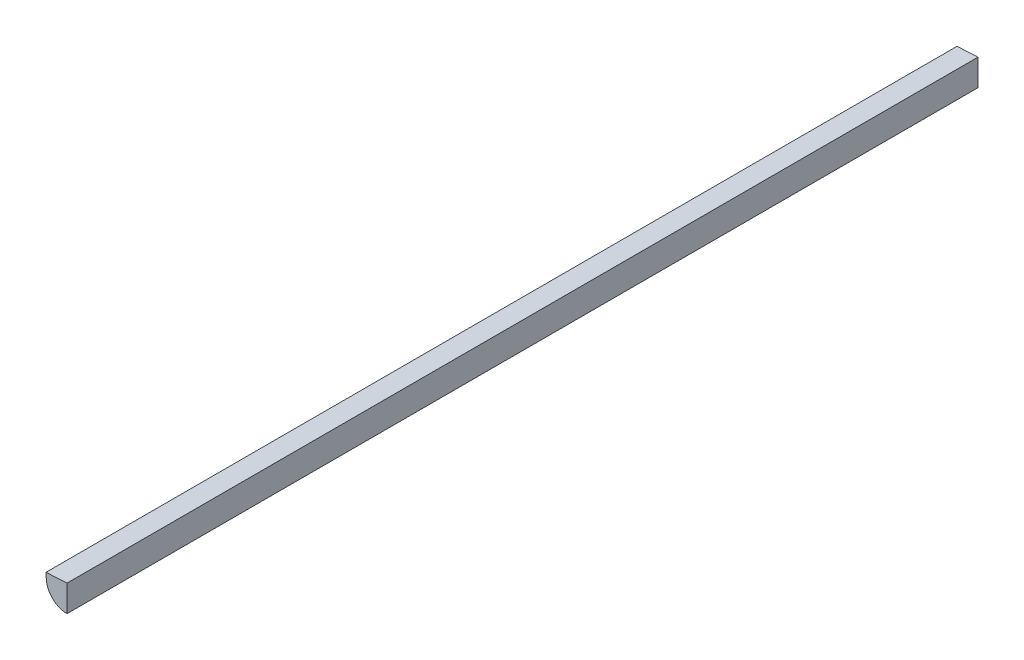
ISO-10303-21;
HEADER;
FILE_DESCRIPTION(('STEP AP214'),'2;1');
FILE_NAME('part.step','',(''),(''),'','','');
FILE_SCHEMA(('AUTOMOTIVE_DESIGN { 1 0 10303 214 1 1 1 1 }'));
ENDSEC;
DATA;
#1=APPLICATION_CONTEXT('core data for automotive mechanical design processes');
#2=APPLICATION_PROTOCOL_DEFINITION('international standard','automotive_design',2000,#1);
#3=PRODUCT_CONTEXT('',#1,'mechanical');
#4=PRODUCT('Part','Part','',(#3));
#5=PRODUCT_RELATED_PRODUCT_CATEGORY('part','',(#4));
#6=PRODUCT_DEFINITION_FORMATION('','',#4);
#7=PRODUCT_DEFINITION_CONTEXT('part definition',#1,'design');
#8=PRODUCT_DEFINITION('design','',#6,#7);
#9=PRODUCT_DEFINITION_SHAPE('','',#8);
#10=(LENGTH_UNIT() NAMED_UNIT(*) SI_UNIT(.MILLI.,.METRE.));
#11=(NAMED_UNIT(*) PLANE_ANGLE_UNIT() SI_UNIT($,.RADIAN.));
#12=(NAMED_UNIT(*) SI_UNIT($,.STERADIAN.) SOLID_ANGLE_UNIT());
#13=UNCERTAINTY_MEASURE_WITH_UNIT(LENGTH_MEASURE(1.E-05),#10,'distance_accuracy_value','');
#14=(GEOMETRIC_REPRESENTATION_CONTEXT(3) GLOBAL_UNCERTAINTY_ASSIGNED_CONTEXT((#13)) GLOBAL_UNIT_ASSIGNED_CONTEXT((#10,
#11,#12)) REPRESENTATION_CONTEXT('',''));
#15=CARTESIAN_POINT('',(0.,0.,0.));
#16=DIRECTION('',(0.,0.,1.));
#17=DIRECTION('',(1.,0.,0.));
#18=AXIS2_PLACEMENT_3D('',#15,#16,#17);
#19=CARTESIAN_POINT('',(0.,0.,550.));
#20=DIRECTION('',(0.,0.,-1.));
#21=DIRECTION('',(-1.,0.,0.));
#22=AXIS2_PLACEMENT_3D('',#19,#20,#21);
#23=CYLINDRICAL_SURFACE('',#22,12.5);
#24=CARTESIAN_POINT('',(0.,0.,0.));
#25=DIRECTION('',(0.,0.,1.));
#26=DIRECTION('',(1.,0.,0.));
#27=AXIS2_PLACEMENT_3D('',#24,#25,#26);
#28=CIRCLE('',#27,12.5);
#29=CARTESIAN_POINT('',(-12.4828691844322,-0.654199453036755,0.));
#30=VERTEX_POINT('',#29);
#31=CARTESIAN_POINT('',(0.,-12.5,0.));
#32=VERTEX_POINT('',#31);
#33=EDGE_CURVE('E97',#30,#32,#28,.T.);
#34=ORIENTED_EDGE('',*,*,#33,.T.);
#35=DIRECTION('',(0.,0.,-1.));
#36=VECTOR('',#35,1.);
#37=CARTESIAN_POINT('',(0.,-12.5,550.));
#38=LINE('',#37,#36);
#39=CARTESIAN_POINT('',(0.,-12.5,550.));
#40=VERTEX_POINT('',#39);
#41=EDGE_CURVE('E11',#40,#32,#38,.T.);
#42=ORIENTED_EDGE('',*,*,#41,.F.);
#43=CARTESIAN_POINT('',(0.,0.,550.));
#44=DIRECTION('',(0.,0.,1.));
#45=DIRECTION('',(1.,0.,0.));
#46=AXIS2_PLACEMENT_3D('',#43,#44,#45);
#47=CIRCLE('',#46,12.5);
#48=CARTESIAN_POINT('',(-12.4828691844322,-0.654199453036755,550.));
#49=VERTEX_POINT('',#48);
#50=EDGE_CURVE('E85',#49,#40,#47,.T.);
#51=ORIENTED_EDGE('',*,*,#50,.F.);
#52=DIRECTION('',(0.,0.,-1.));
#53=VECTOR('',#52,1.);
#54=CARTESIAN_POINT('',(-12.4828691844322,-0.654199453036755,550.));
#55=LINE('',#54,#53);
#56=EDGE_CURVE('E93',#49,#30,#55,.T.);
#57=ORIENTED_EDGE('',*,*,#56,.T.);
#58=EDGE_LOOP('',(#34,#42,#51,#57));
#59=FACE_BOUND('',#58,.T.);
#60=ADVANCED_FACE('F34',(#59),#23,.T.);
#61=CARTESIAN_POINT('',(0.,3.48477576407277,550.));
#62=DIRECTION('',(-1.,0.,0.));
#63=DIRECTION('',(0.,-1.,0.));
#64=AXIS2_PLACEMENT_3D('',#61,#62,#63);
#65=PLANE('',#64);
#66=DIRECTION('',(0.,1.,0.));
#67=VECTOR('',#66,1.);
#68=CARTESIAN_POINT('',(0.,3.48477576407277,0.));
#69=LINE('',#68,#67);
#70=CARTESIAN_POINT('',(0.,3.48477576407277,0.));
#71=VERTEX_POINT('',#70);
#72=EDGE_CURVE('E89',#32,#71,#69,.T.);
#73=ORIENTED_EDGE('',*,*,#72,.T.);
#74=DIRECTION('',(0.,0.,-1.));
#75=VECTOR('',#74,1.);
#76=CARTESIAN_POINT('',(0.,3.48477576407277,550.));
#77=LINE('',#76,#75);
#78=CARTESIAN_POINT('',(0.,3.48477576407277,550.));
#79=VERTEX_POINT('',#78);
#80=EDGE_CURVE('E42',#79,#71,#77,.T.);
#81=ORIENTED_EDGE('',*,*,#80,.F.);
#82=DIRECTION('',(0.,1.,0.));
#83=VECTOR('',#82,1.);
#84=CARTESIAN_POINT('',(0.,0.,550.));
#85=LINE('',#84,#83);
#86=EDGE_CURVE('E80',#40,#79,#85,.T.);
#87=ORIENTED_EDGE('',*,*,#86,.F.);
#88=ORIENTED_EDGE('',*,*,#41,.T.);
#89=EDGE_LOOP('',(#73,#81,#87,#88));
#90=FACE_BOUND('',#89,.T.);
#91=ADVANCED_FACE('F88',(#90),#65,.F.);
#92=CARTESIAN_POINT('',(-12.6649983121576,2.82103132790916,550.));
#93=DIRECTION('',(0.0523359562429408,-0.998629534754574,0.));
#94=DIRECTION('',(0.998629534754574,0.0523359562429408,0.));
#95=AXIS2_PLACEMENT_3D('',#92,#93,#94);
#96=PLANE('',#95);
#97=DIRECTION('',(-0.998629534754574,-0.0523359562429408,0.));
#98=VECTOR('',#97,1.);
#99=CARTESIAN_POINT('',(-12.6649983121576,2.82103132790916,0.));
#100=LINE('',#99,#98);
#101=CARTESIAN_POINT('',(-12.6649983121576,2.82103132790916,0.));
#102=VERTEX_POINT('',#101);
#103=EDGE_CURVE('E67',#71,#102,#100,.T.);
#104=ORIENTED_EDGE('',*,*,#103,.T.);
#105=DIRECTION('',(0.,0.,-1.));
#106=VECTOR('',#105,1.);
#107=CARTESIAN_POINT('',(-12.6649983121576,2.82103132790916,550.));
#108=LINE('',#107,#106);
#109=CARTESIAN_POINT('',(-12.6649983121576,2.82103132790916,550.));
#110=VERTEX_POINT('',#109);
#111=EDGE_CURVE('E90',#110,#102,#108,.T.);
#112=ORIENTED_EDGE('',*,*,#111,.F.);
#113=DIRECTION('',(-0.998629534754574,-0.0523359562429408,0.));
#114=VECTOR('',#113,1.);
#115=CARTESIAN_POINT('',(-12.6649983121576,2.82103132790916,550.));
#116=LINE('',#115,#114);
#117=EDGE_CURVE('E83',#79,#110,#116,.T.);
#118=ORIENTED_EDGE('',*,*,#117,.F.);
#119=ORIENTED_EDGE('',*,*,#80,.T.);
#120=EDGE_LOOP('',(#104,#112,#118,#119));
#121=FACE_BOUND('',#120,.T.);
#122=ADVANCED_FACE('F91',(#121),#96,.F.);
#123=CARTESIAN_POINT('',(-12.4828691844322,-0.654199453036755,550.));
#124=DIRECTION('',(0.998629534754574,0.0523359562429414,0.));
#125=DIRECTION('',(-0.0523359562429414,0.998629534754574,0.));
#126=AXIS2_PLACEMENT_3D('',#123,#124,#125);
#127=PLANE('',#126);
#128=DIRECTION('',(0.0523359562429414,-0.998629534754574,0.));
#129=VECTOR('',#128,1.);
#130=CARTESIAN_POINT('',(-12.4828691844322,-0.654199453036755,0.));
#131=LINE('',#130,#129);
#132=EDGE_CURVE('E73',#102,#30,#131,.T.);
#133=ORIENTED_EDGE('',*,*,#132,.T.);
#134=ORIENTED_EDGE('',*,*,#56,.F.);
#135=DIRECTION('',(0.0523359562429414,-0.998629534754574,0.));
#136=VECTOR('',#135,1.);
#137=CARTESIAN_POINT('',(-12.4828691844322,-0.654199453036755,550.));
#138=LINE('',#137,#136);
#139=EDGE_CURVE('E50',#110,#49,#138,.T.);
#140=ORIENTED_EDGE('',*,*,#139,.F.);
#141=ORIENTED_EDGE('',*,*,#111,.T.);
#142=EDGE_LOOP('',(#133,#134,#140,#141));
#143=FACE_BOUND('',#142,.T.);
#144=ADVANCED_FACE('F104',(#143),#127,.F.);
#145=CARTESIAN_POINT('',(0.,0.,550.));
#146=DIRECTION('',(0.,0.,1.));
#147=DIRECTION('',(1.,0.,0.));
#148=AXIS2_PLACEMENT_3D('',#145,#146,#147);
#149=PLANE('',#148);
#150=ORIENTED_EDGE('',*,*,#50,.T.);
#151=ORIENTED_EDGE('',*,*,#86,.T.);
#152=ORIENTED_EDGE('',*,*,#117,.T.);
#153=ORIENTED_EDGE('',*,*,#139,.T.);
#154=EDGE_LOOP('',(#150,#151,#152,#153));
#155=FACE_BOUND('',#154,.T.);
#156=ADVANCED_FACE('F81',(#155),#149,.T.);
#157=CARTESIAN_POINT('',(0.,0.,0.));
#158=DIRECTION('',(0.,0.,1.));
#159=DIRECTION('',(1.,0.,0.));
#160=AXIS2_PLACEMENT_3D('',#157,#158,#159);
#161=PLANE('',#160);
#162=ORIENTED_EDGE('',*,*,#33,.F.);
#163=ORIENTED_EDGE('',*,*,#132,.F.);
#164=ORIENTED_EDGE('',*,*,#103,.F.);
#165=ORIENTED_EDGE('',*,*,#72,.F.);
#166=EDGE_LOOP('',(#162,#163,#164,#165));
#167=FACE_BOUND('',#166,.T.);
#168=ADVANCED_FACE('F107',(#167),#161,.F.);
#169=CLOSED_SHELL('',(#60,#91,#122,#144,#156,#168));
#170=MANIFOLD_SOLID_BREP('B2',#169);
#171=ADVANCED_BREP_SHAPE_REPRESENTATION('',(#18,#170),#14);
#172=SHAPE_DEFINITION_REPRESENTATION(#9,#171);
ENDSEC;
END-ISO-10303-21;
